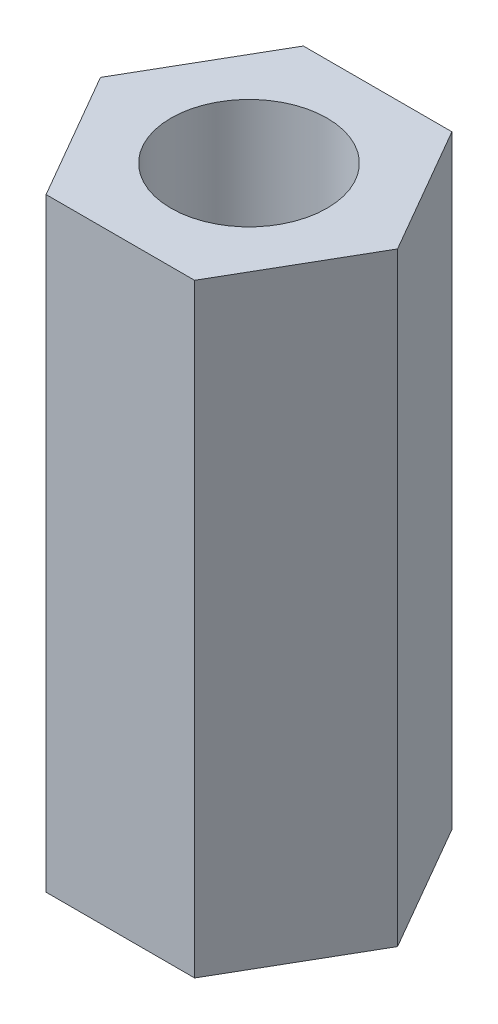
ISO-10303-21;
HEADER;
FILE_DESCRIPTION(('STEP AP214'),'2;1');
FILE_NAME('part.step','',(''),(''),'','','');
FILE_SCHEMA(('AUTOMOTIVE_DESIGN { 1 0 10303 214 1 1 1 1 }'));
ENDSEC;
DATA;
#1=APPLICATION_CONTEXT('core data for automotive mechanical design processes');
#2=APPLICATION_PROTOCOL_DEFINITION('international standard','automotive_design',2000,#1);
#3=PRODUCT_CONTEXT('',#1,'mechanical');
#4=PRODUCT('Part','Part','',(#3));
#5=PRODUCT_RELATED_PRODUCT_CATEGORY('part','',(#4));
#6=PRODUCT_DEFINITION_FORMATION('','',#4);
#7=PRODUCT_DEFINITION_CONTEXT('part definition',#1,'design');
#8=PRODUCT_DEFINITION('design','',#6,#7);
#9=PRODUCT_DEFINITION_SHAPE('','',#8);
#10=(LENGTH_UNIT() NAMED_UNIT(*) SI_UNIT(.MILLI.,.METRE.));
#11=(NAMED_UNIT(*) PLANE_ANGLE_UNIT() SI_UNIT($,.RADIAN.));
#12=(NAMED_UNIT(*) SI_UNIT($,.STERADIAN.) SOLID_ANGLE_UNIT());
#13=UNCERTAINTY_MEASURE_WITH_UNIT(LENGTH_MEASURE(1.E-05),#10,'distance_accuracy_value','');
#14=(GEOMETRIC_REPRESENTATION_CONTEXT(3) GLOBAL_UNCERTAINTY_ASSIGNED_CONTEXT((#13)) GLOBAL_UNIT_ASSIGNED_CONTEXT((#10,
#11,#12)) REPRESENTATION_CONTEXT('',''));
#15=CARTESIAN_POINT('',(0.,0.,0.));
#16=DIRECTION('',(0.,0.,1.));
#17=DIRECTION('',(1.,0.,0.));
#18=AXIS2_PLACEMENT_3D('',#15,#16,#17);
#19=CARTESIAN_POINT('',(2.29496732002873,18.67,3.97500000000001));
#20=DIRECTION('',(-0.866025403784438,0.,-0.5));
#21=DIRECTION('',(-0.5,0.,0.866025403784438));
#22=AXIS2_PLACEMENT_3D('',#19,#20,#21);
#23=PLANE('',#22);
#24=DIRECTION('',(0.5,0.,-0.866025403784438));
#25=VECTOR('',#24,1.);
#26=CARTESIAN_POINT('',(2.29496732002873,0.,3.97500000000001));
#27=LINE('',#26,#25);
#28=CARTESIAN_POINT('',(2.29496732002873,0.,3.97500000000001));
#29=VERTEX_POINT('',#28);
#30=CARTESIAN_POINT('',(4.58993464005751,0.,0.));
#31=VERTEX_POINT('',#30);
#32=EDGE_CURVE('E116',#29,#31,#27,.T.);
#33=ORIENTED_EDGE('',*,*,#32,.T.);
#34=DIRECTION('',(0.,-1.,0.));
#35=VECTOR('',#34,1.);
#36=CARTESIAN_POINT('',(4.58993464005751,18.67,0.));
#37=LINE('',#36,#35);
#38=CARTESIAN_POINT('',(4.58993464005751,18.67,0.));
#39=VERTEX_POINT('',#38);
#40=EDGE_CURVE('E11',#39,#31,#37,.T.);
#41=ORIENTED_EDGE('',*,*,#40,.F.);
#42=DIRECTION('',(0.5,0.,-0.866025403784438));
#43=VECTOR('',#42,1.);
#44=CARTESIAN_POINT('',(2.29496732002873,18.67,3.97500000000001));
#45=LINE('',#44,#43);
#46=CARTESIAN_POINT('',(2.29496732002873,18.67,3.97500000000001));
#47=VERTEX_POINT('',#46);
#48=EDGE_CURVE('E127',#47,#39,#45,.T.);
#49=ORIENTED_EDGE('',*,*,#48,.F.);
#50=DIRECTION('',(0.,-1.,0.));
#51=VECTOR('',#50,1.);
#52=CARTESIAN_POINT('',(2.29496732002873,18.67,3.97500000000001));
#53=LINE('',#52,#51);
#54=EDGE_CURVE('E112',#47,#29,#53,.T.);
#55=ORIENTED_EDGE('',*,*,#54,.T.);
#56=EDGE_LOOP('',(#33,#41,#49,#55));
#57=FACE_BOUND('',#56,.T.);
#58=ADVANCED_FACE('F32',(#57),#23,.F.);
#59=CARTESIAN_POINT('',(4.58993464005751,18.67,0.));
#60=DIRECTION('',(-0.866025403784439,0.,0.499999999999999));
#61=DIRECTION('',(0.499999999999999,0.,0.866025403784439));
#62=AXIS2_PLACEMENT_3D('',#59,#60,#61);
#63=PLANE('',#62);
#64=DIRECTION('',(-0.499999999999999,0.,-0.866025403784439));
#65=VECTOR('',#64,1.);
#66=CARTESIAN_POINT('',(4.58993464005751,0.,0.));
#67=LINE('',#66,#65);
#68=CARTESIAN_POINT('',(2.29496732002874,0.,-3.97500000000003));
#69=VERTEX_POINT('',#68);
#70=EDGE_CURVE('E119',#31,#69,#67,.T.);
#71=ORIENTED_EDGE('',*,*,#70,.T.);
#72=DIRECTION('',(0.,-1.,0.));
#73=VECTOR('',#72,1.);
#74=CARTESIAN_POINT('',(2.29496732002874,18.67,-3.97500000000003));
#75=LINE('',#74,#73);
#76=CARTESIAN_POINT('',(2.29496732002874,18.67,-3.97500000000003));
#77=VERTEX_POINT('',#76);
#78=EDGE_CURVE('E40',#77,#69,#75,.T.);
#79=ORIENTED_EDGE('',*,*,#78,.F.);
#80=DIRECTION('',(-0.499999999999999,0.,-0.866025403784439));
#81=VECTOR('',#80,1.);
#82=CARTESIAN_POINT('',(4.58993464005751,18.67,0.));
#83=LINE('',#82,#81);
#84=EDGE_CURVE('E85',#39,#77,#83,.T.);
#85=ORIENTED_EDGE('',*,*,#84,.F.);
#86=ORIENTED_EDGE('',*,*,#40,.T.);
#87=EDGE_LOOP('',(#71,#79,#85,#86));
#88=FACE_BOUND('',#87,.T.);
#89=ADVANCED_FACE('F152',(#88),#63,.F.);
#90=CARTESIAN_POINT('',(2.29496732002874,18.67,-3.97500000000003));
#91=DIRECTION('',(0.,0.,1.));
#92=DIRECTION('',(1.,0.,0.));
#93=AXIS2_PLACEMENT_3D('',#90,#91,#92);
#94=PLANE('',#93);
#95=DIRECTION('',(-1.,0.,0.));
#96=VECTOR('',#95,1.);
#97=CARTESIAN_POINT('',(2.29496732002874,0.,-3.97500000000003));
#98=LINE('',#97,#96);
#99=CARTESIAN_POINT('',(-2.29496732002878,0.,-3.97500000000003));
#100=VERTEX_POINT('',#99);
#101=EDGE_CURVE('E122',#69,#100,#98,.T.);
#102=ORIENTED_EDGE('',*,*,#101,.T.);
#103=DIRECTION('',(0.,-1.,0.));
#104=VECTOR('',#103,1.);
#105=CARTESIAN_POINT('',(-2.29496732002878,18.67,-3.97500000000003));
#106=LINE('',#105,#104);
#107=CARTESIAN_POINT('',(-2.29496732002878,18.67,-3.97500000000003));
#108=VERTEX_POINT('',#107);
#109=EDGE_CURVE('E107',#108,#100,#106,.T.);
#110=ORIENTED_EDGE('',*,*,#109,.F.);
#111=DIRECTION('',(-1.,0.,0.));
#112=VECTOR('',#111,1.);
#113=CARTESIAN_POINT('',(2.29496732002874,18.67,-3.97500000000003));
#114=LINE('',#113,#112);
#115=EDGE_CURVE('E98',#77,#108,#114,.T.);
#116=ORIENTED_EDGE('',*,*,#115,.F.);
#117=ORIENTED_EDGE('',*,*,#78,.T.);
#118=EDGE_LOOP('',(#102,#110,#116,#117));
#119=FACE_BOUND('',#118,.T.);
#120=ADVANCED_FACE('F133',(#119),#94,.F.);
#121=CARTESIAN_POINT('',(-2.29496732002878,18.67,-3.97500000000003));
#122=DIRECTION('',(0.866025403784439,0.,0.499999999999999));
#123=DIRECTION('',(0.499999999999999,0.,-0.866025403784439));
#124=AXIS2_PLACEMENT_3D('',#121,#122,#123);
#125=PLANE('',#124);
#126=DIRECTION('',(-0.499999999999999,0.,0.866025403784439));
#127=VECTOR('',#126,1.);
#128=CARTESIAN_POINT('',(-2.29496732002878,0.,-3.97500000000003));
#129=LINE('',#128,#127);
#130=CARTESIAN_POINT('',(-4.58993464005755,0.,0.));
#131=VERTEX_POINT('',#130);
#132=EDGE_CURVE('E106',#100,#131,#129,.T.);
#133=ORIENTED_EDGE('',*,*,#132,.T.);
#134=DIRECTION('',(0.,-1.,0.));
#135=VECTOR('',#134,1.);
#136=CARTESIAN_POINT('',(-4.58993464005755,18.67,0.));
#137=LINE('',#136,#135);
#138=CARTESIAN_POINT('',(-4.58993464005755,18.67,0.));
#139=VERTEX_POINT('',#138);
#140=EDGE_CURVE('E103',#139,#131,#137,.T.);
#141=ORIENTED_EDGE('',*,*,#140,.F.);
#142=DIRECTION('',(-0.499999999999999,0.,0.866025403784439));
#143=VECTOR('',#142,1.);
#144=CARTESIAN_POINT('',(-2.29496732002878,18.67,-3.97500000000003));
#145=LINE('',#144,#143);
#146=EDGE_CURVE('E92',#108,#139,#145,.T.);
#147=ORIENTED_EDGE('',*,*,#146,.F.);
#148=ORIENTED_EDGE('',*,*,#109,.T.);
#149=EDGE_LOOP('',(#133,#141,#147,#148));
#150=FACE_BOUND('',#149,.T.);
#151=ADVANCED_FACE('F104',(#150),#125,.F.);
#152=CARTESIAN_POINT('',(-4.58993464005755,18.67,0.));
#153=DIRECTION('',(0.866025403784438,0.,-0.500000000000001));
#154=DIRECTION('',(-0.500000000000001,0.,-0.866025403784438));
#155=AXIS2_PLACEMENT_3D('',#152,#153,#154);
#156=PLANE('',#155);
#157=DIRECTION('',(0.500000000000001,0.,0.866025403784438));
#158=VECTOR('',#157,1.);
#159=CARTESIAN_POINT('',(-4.58993464005755,0.,0.));
#160=LINE('',#159,#158);
#161=CARTESIAN_POINT('',(-2.29496732002878,0.,3.97500000000001));
#162=VERTEX_POINT('',#161);
#163=EDGE_CURVE('E71',#131,#162,#160,.T.);
#164=ORIENTED_EDGE('',*,*,#163,.T.);
#165=DIRECTION('',(0.,-1.,0.));
#166=VECTOR('',#165,1.);
#167=CARTESIAN_POINT('',(-2.29496732002878,18.67,3.97500000000001));
#168=LINE('',#167,#166);
#169=CARTESIAN_POINT('',(-2.29496732002878,18.67,3.97500000000001));
#170=VERTEX_POINT('',#169);
#171=EDGE_CURVE('E108',#170,#162,#168,.T.);
#172=ORIENTED_EDGE('',*,*,#171,.F.);
#173=DIRECTION('',(0.500000000000001,0.,0.866025403784438));
#174=VECTOR('',#173,1.);
#175=CARTESIAN_POINT('',(-4.58993464005755,18.67,0.));
#176=LINE('',#175,#174);
#177=EDGE_CURVE('E96',#139,#170,#176,.T.);
#178=ORIENTED_EDGE('',*,*,#177,.F.);
#179=ORIENTED_EDGE('',*,*,#140,.T.);
#180=EDGE_LOOP('',(#164,#172,#178,#179));
#181=FACE_BOUND('',#180,.T.);
#182=ADVANCED_FACE('F110',(#181),#156,.F.);
#183=CARTESIAN_POINT('',(-2.29496732002878,18.67,3.97500000000001));
#184=DIRECTION('',(0.,0.,-1.));
#185=DIRECTION('',(-1.,0.,0.));
#186=AXIS2_PLACEMENT_3D('',#183,#184,#185);
#187=PLANE('',#186);
#188=DIRECTION('',(1.,0.,0.));
#189=VECTOR('',#188,1.);
#190=CARTESIAN_POINT('',(-2.29496732002878,0.,3.97500000000001));
#191=LINE('',#190,#189);
#192=EDGE_CURVE('E77',#162,#29,#191,.T.);
#193=ORIENTED_EDGE('',*,*,#192,.T.);
#194=ORIENTED_EDGE('',*,*,#54,.F.);
#195=DIRECTION('',(1.,0.,0.));
#196=VECTOR('',#195,1.);
#197=CARTESIAN_POINT('',(-2.29496732002878,18.67,3.97500000000001));
#198=LINE('',#197,#196);
#199=EDGE_CURVE('E48',#170,#47,#198,.T.);
#200=ORIENTED_EDGE('',*,*,#199,.F.);
#201=ORIENTED_EDGE('',*,*,#171,.T.);
#202=EDGE_LOOP('',(#193,#194,#200,#201));
#203=FACE_BOUND('',#202,.T.);
#204=ADVANCED_FACE('F140',(#203),#187,.F.);
#205=CARTESIAN_POINT('',(4.58993464005751,18.67,0.));
#206=DIRECTION('',(0.,1.,0.));
#207=DIRECTION('',(0.,0.,1.));
#208=AXIS2_PLACEMENT_3D('',#205,#206,#207);
#209=PLANE('',#208);
#210=CARTESIAN_POINT('',(0.,18.67,0.));
#211=DIRECTION('',(0.,1.,0.));
#212=DIRECTION('',(0.,0.,1.));
#213=AXIS2_PLACEMENT_3D('',#210,#211,#212);
#214=CIRCLE('',#213,2.41299999999999);
#215=CARTESIAN_POINT('',(0.,18.67,2.41299999999999));
#216=VERTEX_POINT('',#215);
#217=EDGE_CURVE('E207',#216,#216,#214,.T.);
#218=ORIENTED_EDGE('',*,*,#217,.F.);
#219=EDGE_LOOP('',(#218));
#220=FACE_BOUND('',#219,.T.);
#221=ORIENTED_EDGE('',*,*,#48,.T.);
#222=ORIENTED_EDGE('',*,*,#84,.T.);
#223=ORIENTED_EDGE('',*,*,#115,.T.);
#224=ORIENTED_EDGE('',*,*,#146,.T.);
#225=ORIENTED_EDGE('',*,*,#177,.T.);
#226=ORIENTED_EDGE('',*,*,#199,.T.);
#227=EDGE_LOOP('',(#221,#222,#223,#224,#225,#226));
#228=FACE_BOUND('',#227,.T.);
#229=ADVANCED_FACE('F94',(#220,#228),#209,.T.);
#230=CARTESIAN_POINT('',(4.58993464005751,0.,0.));
#231=DIRECTION('',(0.,1.,0.));
#232=DIRECTION('',(0.,0.,1.));
#233=AXIS2_PLACEMENT_3D('',#230,#231,#232);
#234=PLANE('',#233);
#235=CARTESIAN_POINT('',(0.,0.,0.));
#236=DIRECTION('',(0.,1.,0.));
#237=DIRECTION('',(0.,0.,1.));
#238=AXIS2_PLACEMENT_3D('',#235,#236,#237);
#239=CIRCLE('',#238,2.413);
#240=CARTESIAN_POINT('',(0.,0.,2.413));
#241=VERTEX_POINT('',#240);
#242=EDGE_CURVE('E120',#241,#241,#239,.T.);
#243=ORIENTED_EDGE('',*,*,#242,.T.);
#244=EDGE_LOOP('',(#243));
#245=FACE_BOUND('',#244,.T.);
#246=ORIENTED_EDGE('',*,*,#32,.F.);
#247=ORIENTED_EDGE('',*,*,#192,.F.);
#248=ORIENTED_EDGE('',*,*,#163,.F.);
#249=ORIENTED_EDGE('',*,*,#132,.F.);
#250=ORIENTED_EDGE('',*,*,#101,.F.);
#251=ORIENTED_EDGE('',*,*,#70,.F.);
#252=EDGE_LOOP('',(#246,#247,#248,#249,#250,#251));
#253=FACE_BOUND('',#252,.T.);
#254=ADVANCED_FACE('F136',(#245,#253),#234,.F.);
#255=CARTESIAN_POINT('',(0.,18.67,0.));
#256=DIRECTION('',(0.,1.,0.));
#257=DIRECTION('',(0.,0.,1.));
#258=AXIS2_PLACEMENT_3D('',#255,#256,#257);
#259=CYLINDRICAL_SURFACE('',#258,2.41299999999999);
#260=ORIENTED_EDGE('',*,*,#242,.F.);
#261=EDGE_LOOP('',(#260));
#262=FACE_BOUND('',#261,.T.);
#263=ORIENTED_EDGE('',*,*,#217,.T.);
#264=EDGE_LOOP('',(#263));
#265=FACE_BOUND('',#264,.T.);
#266=ADVANCED_FACE('F189',(#262,#265),#259,.F.);
#267=CLOSED_SHELL('',(#58,#89,#120,#151,#182,#204,#229,#254,#266));
#268=MANIFOLD_SOLID_BREP('B2',#267);
#269=ADVANCED_BREP_SHAPE_REPRESENTATION('',(#18,#268),#14);
#270=SHAPE_DEFINITION_REPRESENTATION(#9,#269);
ENDSEC;
END-ISO-10303-21;
